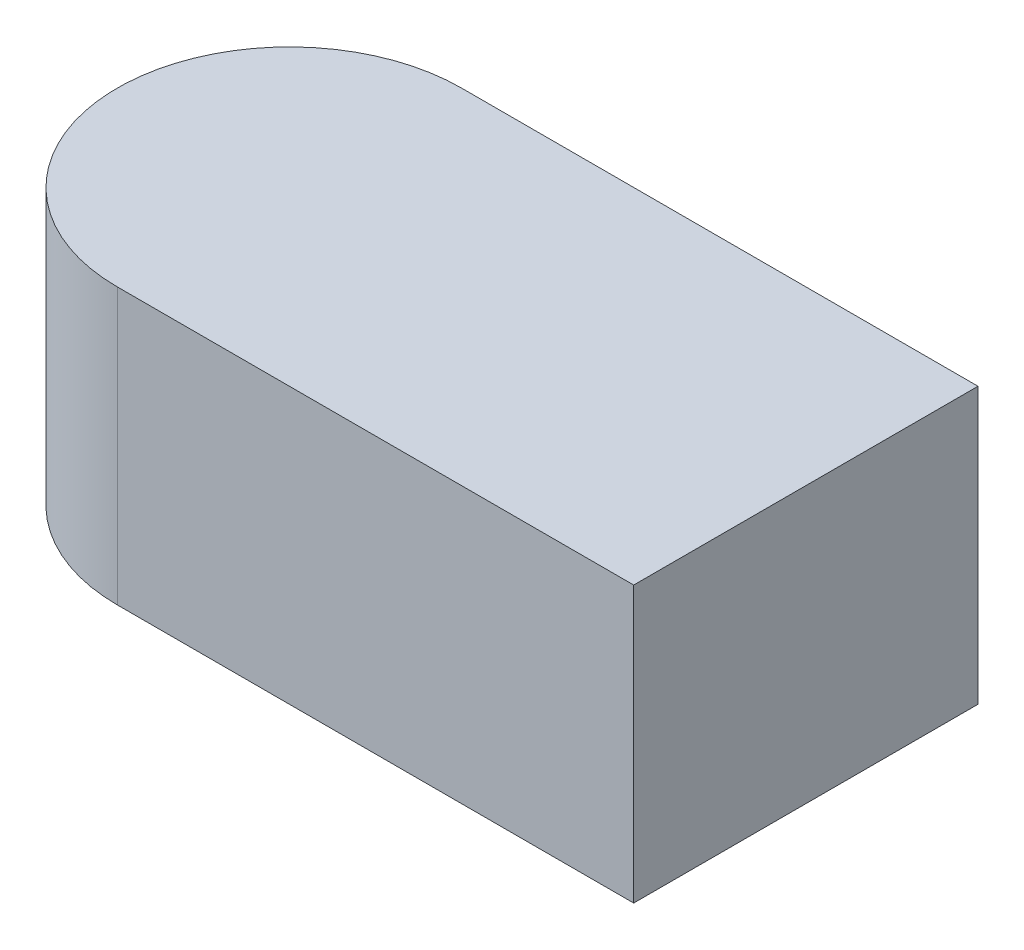
ISO-10303-21;
HEADER;
FILE_DESCRIPTION(('STEP AP214'),'2;1');
FILE_NAME('part.step','',(''),(''),'','','');
FILE_SCHEMA(('AUTOMOTIVE_DESIGN { 1 0 10303 214 1 1 1 1 }'));
ENDSEC;
DATA;
#1=APPLICATION_CONTEXT('core data for automotive mechanical design processes');
#2=APPLICATION_PROTOCOL_DEFINITION('international standard','automotive_design',2000,#1);
#3=PRODUCT_CONTEXT('',#1,'mechanical');
#4=PRODUCT('Part','Part','',(#3));
#5=PRODUCT_RELATED_PRODUCT_CATEGORY('part','',(#4));
#6=PRODUCT_DEFINITION_FORMATION('','',#4);
#7=PRODUCT_DEFINITION_CONTEXT('part definition',#1,'design');
#8=PRODUCT_DEFINITION('design','',#6,#7);
#9=PRODUCT_DEFINITION_SHAPE('','',#8);
#10=(LENGTH_UNIT() NAMED_UNIT(*) SI_UNIT(.MILLI.,.METRE.));
#11=(NAMED_UNIT(*) PLANE_ANGLE_UNIT() SI_UNIT($,.RADIAN.));
#12=(NAMED_UNIT(*) SI_UNIT($,.STERADIAN.) SOLID_ANGLE_UNIT());
#13=UNCERTAINTY_MEASURE_WITH_UNIT(LENGTH_MEASURE(1.E-05),#10,'distance_accuracy_value','');
#14=(GEOMETRIC_REPRESENTATION_CONTEXT(3) GLOBAL_UNCERTAINTY_ASSIGNED_CONTEXT((#13)) GLOBAL_UNIT_ASSIGNED_CONTEXT((#10,
#11,#12)) REPRESENTATION_CONTEXT('',''));
#15=CARTESIAN_POINT('',(0.,0.,0.));
#16=DIRECTION('',(0.,0.,1.));
#17=DIRECTION('',(1.,0.,0.));
#18=AXIS2_PLACEMENT_3D('',#15,#16,#17);
#19=CARTESIAN_POINT('',(0.,0.2,0.));
#20=DIRECTION('',(0.,-1.,0.));
#21=DIRECTION('',(0.,0.,-1.));
#22=AXIS2_PLACEMENT_3D('',#19,#20,#21);
#23=PLANE('',#22);
#24=CARTESIAN_POINT('',(2.125,0.2,-2.));
#25=DIRECTION('',(0.,-1.,0.));
#26=DIRECTION('',(0.,0.,-1.));
#27=AXIS2_PLACEMENT_3D('',#24,#25,#26);
#28=CIRCLE('',#27,0.125);
#29=CARTESIAN_POINT('',(2.125,0.2,-1.875));
#30=VERTEX_POINT('',#29);
#31=CARTESIAN_POINT('',(2.125,0.2,-2.125));
#32=VERTEX_POINT('',#31);
#33=EDGE_CURVE('E20',#30,#32,#28,.T.);
#34=ORIENTED_EDGE('',*,*,#33,.F.);
#35=DIRECTION('',(-1.,0.,0.));
#36=VECTOR('',#35,1.);
#37=CARTESIAN_POINT('',(2.5,0.2,-1.875));
#38=LINE('',#37,#36);
#39=CARTESIAN_POINT('',(2.5,0.2,-1.875));
#40=VERTEX_POINT('',#39);
#41=EDGE_CURVE('E55',#30,#40,#38,.F.);
#42=ORIENTED_EDGE('',*,*,#41,.T.);
#43=DIRECTION('',(0.,0.,1.));
#44=VECTOR('',#43,1.);
#45=CARTESIAN_POINT('',(2.5,0.2,-2.125));
#46=LINE('',#45,#44);
#47=CARTESIAN_POINT('',(2.5,0.2,-2.125));
#48=VERTEX_POINT('',#47);
#49=EDGE_CURVE('E63',#40,#48,#46,.F.);
#50=ORIENTED_EDGE('',*,*,#49,.T.);
#51=DIRECTION('',(1.,0.,0.));
#52=VECTOR('',#51,1.);
#53=CARTESIAN_POINT('',(2.125,0.2,-2.125));
#54=LINE('',#53,#52);
#55=EDGE_CURVE('E59',#48,#32,#54,.F.);
#56=ORIENTED_EDGE('',*,*,#55,.T.);
#57=EDGE_LOOP('',(#34,#42,#50,#56));
#58=FACE_BOUND('',#57,.T.);
#59=ADVANCED_FACE('F17',(#58),#23,.F.);
#60=CARTESIAN_POINT('',(2.5,0.,-1.875));
#61=DIRECTION('',(0.,0.,-1.));
#62=DIRECTION('',(-1.,0.,0.));
#63=AXIS2_PLACEMENT_3D('',#60,#61,#62);
#64=PLANE('',#63);
#65=ORIENTED_EDGE('',*,*,#41,.F.);
#66=DIRECTION('',(0.,-1.,0.));
#67=VECTOR('',#66,1.);
#68=CARTESIAN_POINT('',(2.125,0.,-1.875));
#69=LINE('',#68,#67);
#70=CARTESIAN_POINT('',(2.125,0.,-1.875));
#71=VERTEX_POINT('',#70);
#72=EDGE_CURVE('E70',#71,#30,#69,.F.);
#73=ORIENTED_EDGE('',*,*,#72,.F.);
#74=DIRECTION('',(1.,0.,0.));
#75=VECTOR('',#74,1.);
#76=CARTESIAN_POINT('',(0.,0.,-1.875));
#77=LINE('',#76,#75);
#78=CARTESIAN_POINT('',(2.5,0.,-1.875));
#79=VERTEX_POINT('',#78);
#80=EDGE_CURVE('E84',#79,#71,#77,.F.);
#81=ORIENTED_EDGE('',*,*,#80,.F.);
#82=DIRECTION('',(0.,1.,0.));
#83=VECTOR('',#82,1.);
#84=CARTESIAN_POINT('',(2.5,0.,-1.875));
#85=LINE('',#84,#83);
#86=EDGE_CURVE('E74',#79,#40,#85,.T.);
#87=ORIENTED_EDGE('',*,*,#86,.T.);
#88=EDGE_LOOP('',(#65,#73,#81,#87));
#89=FACE_BOUND('',#88,.T.);
#90=ADVANCED_FACE('F105',(#89),#64,.F.);
#91=CARTESIAN_POINT('',(2.125,0.,-2.));
#92=DIRECTION('',(0.,-1.,0.));
#93=DIRECTION('',(0.,0.,-1.));
#94=AXIS2_PLACEMENT_3D('',#91,#92,#93);
#95=CYLINDRICAL_SURFACE('',#94,0.125);
#96=DIRECTION('',(0.,1.,0.));
#97=VECTOR('',#96,1.);
#98=CARTESIAN_POINT('',(2.125,0.,-2.125));
#99=LINE('',#98,#97);
#100=CARTESIAN_POINT('',(2.125,0.,-2.125));
#101=VERTEX_POINT('',#100);
#102=EDGE_CURVE('E65',#32,#101,#99,.F.);
#103=ORIENTED_EDGE('',*,*,#102,.T.);
#104=CARTESIAN_POINT('',(2.125,0.,-2.));
#105=DIRECTION('',(0.,-1.,0.));
#106=DIRECTION('',(0.,0.,-1.));
#107=AXIS2_PLACEMENT_3D('',#104,#105,#106);
#108=CIRCLE('',#107,0.125);
#109=EDGE_CURVE('E97',#71,#101,#108,.T.);
#110=ORIENTED_EDGE('',*,*,#109,.F.);
#111=ORIENTED_EDGE('',*,*,#72,.T.);
#112=ORIENTED_EDGE('',*,*,#33,.T.);
#113=EDGE_LOOP('',(#103,#110,#111,#112));
#114=FACE_BOUND('',#113,.T.);
#115=ADVANCED_FACE('F68',(#114),#95,.T.);
#116=CARTESIAN_POINT('',(2.125,0.,-2.125));
#117=DIRECTION('',(0.,0.,1.));
#118=DIRECTION('',(1.,0.,0.));
#119=AXIS2_PLACEMENT_3D('',#116,#117,#118);
#120=PLANE('',#119);
#121=ORIENTED_EDGE('',*,*,#55,.F.);
#122=DIRECTION('',(0.,1.,0.));
#123=VECTOR('',#122,1.);
#124=CARTESIAN_POINT('',(2.5,0.,-2.125));
#125=LINE('',#124,#123);
#126=CARTESIAN_POINT('',(2.5,0.,-2.125));
#127=VERTEX_POINT('',#126);
#128=EDGE_CURVE('E35',#48,#127,#125,.F.);
#129=ORIENTED_EDGE('',*,*,#128,.T.);
#130=DIRECTION('',(1.,0.,0.));
#131=VECTOR('',#130,1.);
#132=CARTESIAN_POINT('',(0.,0.,-2.125));
#133=LINE('',#132,#131);
#134=EDGE_CURVE('E26',#101,#127,#133,.T.);
#135=ORIENTED_EDGE('',*,*,#134,.F.);
#136=ORIENTED_EDGE('',*,*,#102,.F.);
#137=EDGE_LOOP('',(#121,#129,#135,#136));
#138=FACE_BOUND('',#137,.T.);
#139=ADVANCED_FACE('F71',(#138),#120,.F.);
#140=CARTESIAN_POINT('',(2.5,0.,-2.125));
#141=DIRECTION('',(-1.,0.,0.));
#142=DIRECTION('',(0.,0.,1.));
#143=AXIS2_PLACEMENT_3D('',#140,#141,#142);
#144=PLANE('',#143);
#145=ORIENTED_EDGE('',*,*,#49,.F.);
#146=ORIENTED_EDGE('',*,*,#86,.F.);
#147=DIRECTION('',(0.,0.,-1.));
#148=VECTOR('',#147,1.);
#149=CARTESIAN_POINT('',(2.5,0.,0.));
#150=LINE('',#149,#148);
#151=EDGE_CURVE('E11',#127,#79,#150,.F.);
#152=ORIENTED_EDGE('',*,*,#151,.F.);
#153=ORIENTED_EDGE('',*,*,#128,.F.);
#154=EDGE_LOOP('',(#145,#146,#152,#153));
#155=FACE_BOUND('',#154,.T.);
#156=ADVANCED_FACE('F107',(#155),#144,.F.);
#157=CARTESIAN_POINT('',(0.,0.,0.));
#158=DIRECTION('',(0.,-1.,0.));
#159=DIRECTION('',(0.,0.,-1.));
#160=AXIS2_PLACEMENT_3D('',#157,#158,#159);
#161=PLANE('',#160);
#162=ORIENTED_EDGE('',*,*,#134,.T.);
#163=ORIENTED_EDGE('',*,*,#151,.T.);
#164=ORIENTED_EDGE('',*,*,#80,.T.);
#165=ORIENTED_EDGE('',*,*,#109,.T.);
#166=EDGE_LOOP('',(#162,#163,#164,#165));
#167=FACE_BOUND('',#166,.T.);
#168=ADVANCED_FACE('F103',(#167),#161,.T.);
#169=CLOSED_SHELL('',(#59,#90,#115,#139,#156,#168));
#170=MANIFOLD_SOLID_BREP('B1',#169);
#171=ADVANCED_BREP_SHAPE_REPRESENTATION('',(#18,#170),#14);
#172=SHAPE_DEFINITION_REPRESENTATION(#9,#171);
ENDSEC;
END-ISO-10303-21;
